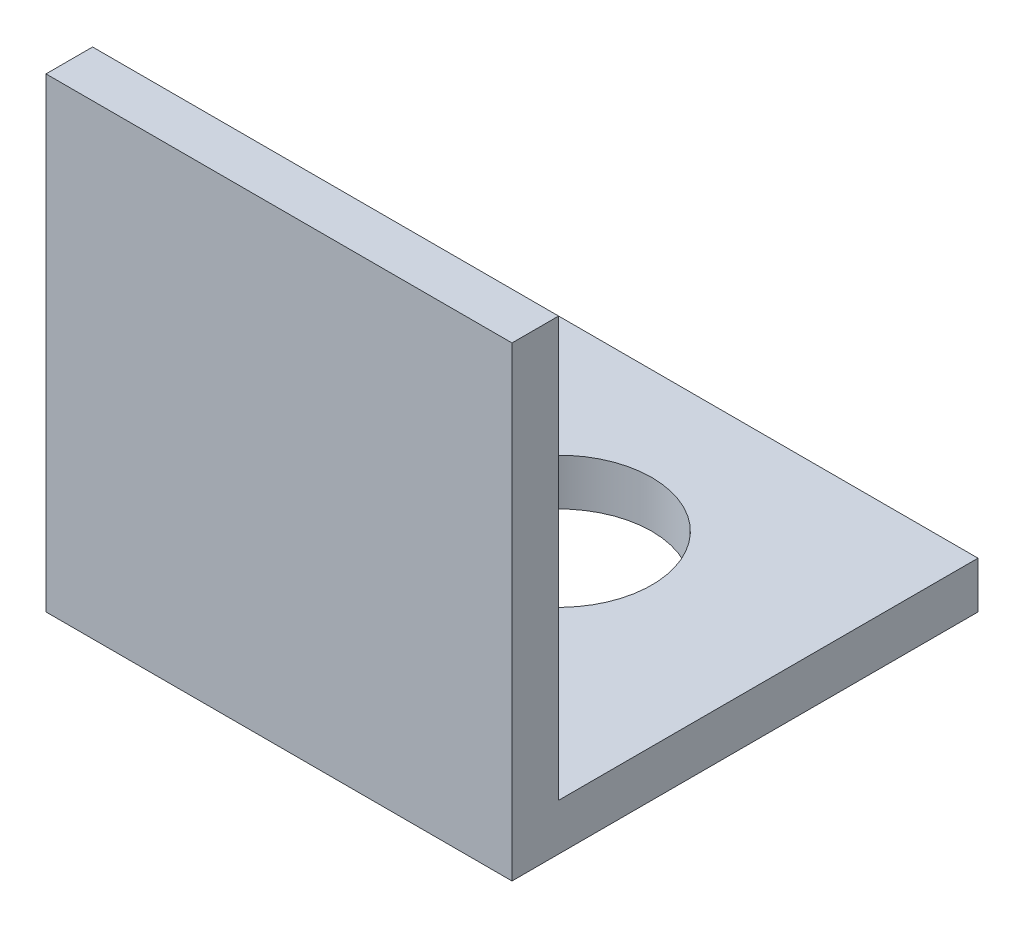
ISO-10303-21;
HEADER;
FILE_DESCRIPTION(('STEP AP214'),'2;1');
FILE_NAME('part.step','',(''),(''),'','','');
FILE_SCHEMA(('AUTOMOTIVE_DESIGN { 1 0 10303 214 1 1 1 1 }'));
ENDSEC;
DATA;
#1=APPLICATION_CONTEXT('core data for automotive mechanical design processes');
#2=APPLICATION_PROTOCOL_DEFINITION('international standard','automotive_design',2000,#1);
#3=PRODUCT_CONTEXT('',#1,'mechanical');
#4=PRODUCT('Part','Part','',(#3));
#5=PRODUCT_RELATED_PRODUCT_CATEGORY('part','',(#4));
#6=PRODUCT_DEFINITION_FORMATION('','',#4);
#7=PRODUCT_DEFINITION_CONTEXT('part definition',#1,'design');
#8=PRODUCT_DEFINITION('design','',#6,#7);
#9=PRODUCT_DEFINITION_SHAPE('','',#8);
#10=(LENGTH_UNIT() NAMED_UNIT(*) SI_UNIT(.MILLI.,.METRE.));
#11=(NAMED_UNIT(*) PLANE_ANGLE_UNIT() SI_UNIT($,.RADIAN.));
#12=(NAMED_UNIT(*) SI_UNIT($,.STERADIAN.) SOLID_ANGLE_UNIT());
#13=UNCERTAINTY_MEASURE_WITH_UNIT(LENGTH_MEASURE(1.E-05),#10,'distance_accuracy_value','');
#14=(GEOMETRIC_REPRESENTATION_CONTEXT(3) GLOBAL_UNCERTAINTY_ASSIGNED_CONTEXT((#13)) GLOBAL_UNIT_ASSIGNED_CONTEXT((#10,
#11,#12)) REPRESENTATION_CONTEXT('',''));
#15=CARTESIAN_POINT('',(0.,0.,0.));
#16=DIRECTION('',(0.,0.,1.));
#17=DIRECTION('',(1.,0.,0.));
#18=AXIS2_PLACEMENT_3D('',#15,#16,#17);
#19=CARTESIAN_POINT('',(30.,0.,0.));
#20=DIRECTION('',(0.,1.,0.));
#21=DIRECTION('',(0.,0.,1.));
#22=AXIS2_PLACEMENT_3D('',#19,#20,#21);
#23=PLANE('',#22);
#24=CARTESIAN_POINT('',(15.,0.,-18.));
#25=DIRECTION('',(0.,-1.,0.));
#26=DIRECTION('',(0.,0.,-1.));
#27=AXIS2_PLACEMENT_3D('',#24,#25,#26);
#28=CIRCLE('',#27,6.);
#29=CARTESIAN_POINT('',(15.,0.,-24.));
#30=VERTEX_POINT('',#29);
#31=EDGE_CURVE('E161',#30,#30,#28,.T.);
#32=ORIENTED_EDGE('',*,*,#31,.F.);
#33=EDGE_LOOP('',(#32));
#34=FACE_BOUND('',#33,.T.);
#35=DIRECTION('',(0.,0.,-1.));
#36=VECTOR('',#35,1.);
#37=CARTESIAN_POINT('',(0.,0.,0.));
#38=LINE('',#37,#36);
#39=CARTESIAN_POINT('',(0.,0.,0.));
#40=VERTEX_POINT('',#39);
#41=CARTESIAN_POINT('',(0.,0.,-30.));
#42=VERTEX_POINT('',#41);
#43=EDGE_CURVE('E117',#40,#42,#38,.T.);
#44=ORIENTED_EDGE('',*,*,#43,.T.);
#45=DIRECTION('',(-1.,0.,0.));
#46=VECTOR('',#45,1.);
#47=CARTESIAN_POINT('',(30.,0.,-30.));
#48=LINE('',#47,#46);
#49=CARTESIAN_POINT('',(30.,0.,-30.));
#50=VERTEX_POINT('',#49);
#51=EDGE_CURVE('E11',#50,#42,#48,.T.);
#52=ORIENTED_EDGE('',*,*,#51,.F.);
#53=DIRECTION('',(0.,0.,-1.));
#54=VECTOR('',#53,1.);
#55=CARTESIAN_POINT('',(30.,0.,0.));
#56=LINE('',#55,#54);
#57=CARTESIAN_POINT('',(30.,0.,0.));
#58=VERTEX_POINT('',#57);
#59=EDGE_CURVE('E82',#58,#50,#56,.T.);
#60=ORIENTED_EDGE('',*,*,#59,.F.);
#61=DIRECTION('',(-1.,0.,0.));
#62=VECTOR('',#61,1.);
#63=CARTESIAN_POINT('',(30.,0.,0.));
#64=LINE('',#63,#62);
#65=EDGE_CURVE('E113',#58,#40,#64,.T.);
#66=ORIENTED_EDGE('',*,*,#65,.T.);
#67=EDGE_LOOP('',(#44,#52,#60,#66));
#68=FACE_BOUND('',#67,.T.);
#69=ADVANCED_FACE('F35',(#34,#68),#23,.F.);
#70=CARTESIAN_POINT('',(30.,3.,-30.));
#71=DIRECTION('',(0.,0.,-1.));
#72=DIRECTION('',(-1.,0.,0.));
#73=AXIS2_PLACEMENT_3D('',#70,#71,#72);
#74=PLANE('',#73);
#75=DIRECTION('',(0.,-1.,0.));
#76=VECTOR('',#75,1.);
#77=CARTESIAN_POINT('',(0.,3.,-30.));
#78=LINE('',#77,#76);
#79=CARTESIAN_POINT('',(0.,3.,-30.));
#80=VERTEX_POINT('',#79);
#81=EDGE_CURVE('E120',#80,#42,#78,.T.);
#82=ORIENTED_EDGE('',*,*,#81,.F.);
#83=DIRECTION('',(-1.,0.,0.));
#84=VECTOR('',#83,1.);
#85=CARTESIAN_POINT('',(30.,3.,-30.));
#86=LINE('',#85,#84);
#87=CARTESIAN_POINT('',(30.,3.,-30.));
#88=VERTEX_POINT('',#87);
#89=EDGE_CURVE('E44',#88,#80,#86,.T.);
#90=ORIENTED_EDGE('',*,*,#89,.F.);
#91=DIRECTION('',(0.,-1.,0.));
#92=VECTOR('',#91,1.);
#93=CARTESIAN_POINT('',(30.,3.,-30.));
#94=LINE('',#93,#92);
#95=EDGE_CURVE('E167',#88,#50,#94,.T.);
#96=ORIENTED_EDGE('',*,*,#95,.T.);
#97=ORIENTED_EDGE('',*,*,#51,.T.);
#98=EDGE_LOOP('',(#82,#90,#96,#97));
#99=FACE_BOUND('',#98,.T.);
#100=ADVANCED_FACE('F139',(#99),#74,.T.);
#101=CARTESIAN_POINT('',(30.,3.,0.));
#102=DIRECTION('',(0.,1.,0.));
#103=DIRECTION('',(0.,0.,1.));
#104=AXIS2_PLACEMENT_3D('',#101,#102,#103);
#105=PLANE('',#104);
#106=CARTESIAN_POINT('',(15.,3.,-18.));
#107=DIRECTION('',(0.,1.,0.));
#108=DIRECTION('',(0.,0.,1.));
#109=AXIS2_PLACEMENT_3D('',#106,#107,#108);
#110=CIRCLE('',#109,6.);
#111=CARTESIAN_POINT('',(15.,3.,-12.));
#112=VERTEX_POINT('',#111);
#113=EDGE_CURVE('E38',#112,#112,#110,.T.);
#114=ORIENTED_EDGE('',*,*,#113,.F.);
#115=EDGE_LOOP('',(#114));
#116=FACE_BOUND('',#115,.T.);
#117=DIRECTION('',(0.,0.,-1.));
#118=VECTOR('',#117,1.);
#119=CARTESIAN_POINT('',(0.,3.,0.));
#120=LINE('',#119,#118);
#121=CARTESIAN_POINT('',(0.,3.,-3.));
#122=VERTEX_POINT('',#121);
#123=EDGE_CURVE('E123',#122,#80,#120,.T.);
#124=ORIENTED_EDGE('',*,*,#123,.F.);
#125=DIRECTION('',(-1.,0.,0.));
#126=VECTOR('',#125,1.);
#127=CARTESIAN_POINT('',(30.,3.,-3.));
#128=LINE('',#127,#126);
#129=CARTESIAN_POINT('',(30.,3.,-3.));
#130=VERTEX_POINT('',#129);
#131=EDGE_CURVE('E103',#130,#122,#128,.T.);
#132=ORIENTED_EDGE('',*,*,#131,.F.);
#133=DIRECTION('',(0.,0.,-1.));
#134=VECTOR('',#133,1.);
#135=CARTESIAN_POINT('',(30.,3.,0.));
#136=LINE('',#135,#134);
#137=EDGE_CURVE('E109',#130,#88,#136,.T.);
#138=ORIENTED_EDGE('',*,*,#137,.T.);
#139=ORIENTED_EDGE('',*,*,#89,.T.);
#140=EDGE_LOOP('',(#124,#132,#138,#139));
#141=FACE_BOUND('',#140,.T.);
#142=ADVANCED_FACE('F136',(#116,#141),#105,.T.);
#143=CARTESIAN_POINT('',(30.,30.,-3.));
#144=DIRECTION('',(0.,0.,-1.));
#145=DIRECTION('',(0.,1.,0.));
#146=AXIS2_PLACEMENT_3D('',#143,#144,#145);
#147=PLANE('',#146);
#148=DIRECTION('',(0.,-1.,0.));
#149=VECTOR('',#148,1.);
#150=CARTESIAN_POINT('',(0.,30.,-3.));
#151=LINE('',#150,#149);
#152=CARTESIAN_POINT('',(0.,30.,-3.));
#153=VERTEX_POINT('',#152);
#154=EDGE_CURVE('E98',#153,#122,#151,.T.);
#155=ORIENTED_EDGE('',*,*,#154,.F.);
#156=DIRECTION('',(-1.,0.,0.));
#157=VECTOR('',#156,1.);
#158=CARTESIAN_POINT('',(30.,30.,-3.));
#159=LINE('',#158,#157);
#160=CARTESIAN_POINT('',(30.,30.,-3.));
#161=VERTEX_POINT('',#160);
#162=EDGE_CURVE('E93',#161,#153,#159,.T.);
#163=ORIENTED_EDGE('',*,*,#162,.F.);
#164=DIRECTION('',(0.,-1.,0.));
#165=VECTOR('',#164,1.);
#166=CARTESIAN_POINT('',(30.,30.,-3.));
#167=LINE('',#166,#165);
#168=EDGE_CURVE('E96',#161,#130,#167,.T.);
#169=ORIENTED_EDGE('',*,*,#168,.T.);
#170=ORIENTED_EDGE('',*,*,#131,.T.);
#171=EDGE_LOOP('',(#155,#163,#169,#170));
#172=FACE_BOUND('',#171,.T.);
#173=ADVANCED_FACE('F95',(#172),#147,.T.);
#174=CARTESIAN_POINT('',(30.,30.,0.));
#175=DIRECTION('',(0.,1.,0.));
#176=DIRECTION('',(0.,0.,1.));
#177=AXIS2_PLACEMENT_3D('',#174,#175,#176);
#178=PLANE('',#177);
#179=DIRECTION('',(0.,0.,-1.));
#180=VECTOR('',#179,1.);
#181=CARTESIAN_POINT('',(0.,30.,0.));
#182=LINE('',#181,#180);
#183=CARTESIAN_POINT('',(0.,30.,0.));
#184=VERTEX_POINT('',#183);
#185=EDGE_CURVE('E127',#184,#153,#182,.T.);
#186=ORIENTED_EDGE('',*,*,#185,.F.);
#187=DIRECTION('',(-1.,0.,0.));
#188=VECTOR('',#187,1.);
#189=CARTESIAN_POINT('',(30.,30.,0.));
#190=LINE('',#189,#188);
#191=CARTESIAN_POINT('',(30.,30.,0.));
#192=VERTEX_POINT('',#191);
#193=EDGE_CURVE('E73',#192,#184,#190,.T.);
#194=ORIENTED_EDGE('',*,*,#193,.F.);
#195=DIRECTION('',(0.,0.,-1.));
#196=VECTOR('',#195,1.);
#197=CARTESIAN_POINT('',(30.,30.,0.));
#198=LINE('',#197,#196);
#199=EDGE_CURVE('E107',#192,#161,#198,.T.);
#200=ORIENTED_EDGE('',*,*,#199,.T.);
#201=ORIENTED_EDGE('',*,*,#162,.T.);
#202=EDGE_LOOP('',(#186,#194,#200,#201));
#203=FACE_BOUND('',#202,.T.);
#204=ADVANCED_FACE('F111',(#203),#178,.T.);
#205=CARTESIAN_POINT('',(30.,30.,0.));
#206=DIRECTION('',(0.,0.,-1.));
#207=DIRECTION('',(0.,1.,0.));
#208=AXIS2_PLACEMENT_3D('',#205,#206,#207);
#209=PLANE('',#208);
#210=DIRECTION('',(0.,-1.,0.));
#211=VECTOR('',#210,1.);
#212=CARTESIAN_POINT('',(0.,30.,0.));
#213=LINE('',#212,#211);
#214=EDGE_CURVE('E76',#184,#40,#213,.T.);
#215=ORIENTED_EDGE('',*,*,#214,.T.);
#216=ORIENTED_EDGE('',*,*,#65,.F.);
#217=DIRECTION('',(0.,-1.,0.));
#218=VECTOR('',#217,1.);
#219=CARTESIAN_POINT('',(30.,30.,0.));
#220=LINE('',#219,#218);
#221=EDGE_CURVE('E52',#192,#58,#220,.T.);
#222=ORIENTED_EDGE('',*,*,#221,.F.);
#223=ORIENTED_EDGE('',*,*,#193,.T.);
#224=EDGE_LOOP('',(#215,#216,#222,#223));
#225=FACE_BOUND('',#224,.T.);
#226=ADVANCED_FACE('F144',(#225),#209,.F.);
#227=CARTESIAN_POINT('',(30.,0.,0.));
#228=DIRECTION('',(-1.,0.,0.));
#229=DIRECTION('',(0.,0.,1.));
#230=AXIS2_PLACEMENT_3D('',#227,#228,#229);
#231=PLANE('',#230);
#232=ORIENTED_EDGE('',*,*,#59,.T.);
#233=ORIENTED_EDGE('',*,*,#95,.F.);
#234=ORIENTED_EDGE('',*,*,#137,.F.);
#235=ORIENTED_EDGE('',*,*,#168,.F.);
#236=ORIENTED_EDGE('',*,*,#199,.F.);
#237=ORIENTED_EDGE('',*,*,#221,.T.);
#238=EDGE_LOOP('',(#232,#233,#234,#235,#236,#237));
#239=FACE_BOUND('',#238,.T.);
#240=ADVANCED_FACE('F106',(#239),#231,.F.);
#241=CARTESIAN_POINT('',(0.,0.,0.));
#242=DIRECTION('',(-1.,0.,0.));
#243=DIRECTION('',(0.,0.,1.));
#244=AXIS2_PLACEMENT_3D('',#241,#242,#243);
#245=PLANE('',#244);
#246=ORIENTED_EDGE('',*,*,#43,.F.);
#247=ORIENTED_EDGE('',*,*,#214,.F.);
#248=ORIENTED_EDGE('',*,*,#185,.T.);
#249=ORIENTED_EDGE('',*,*,#154,.T.);
#250=ORIENTED_EDGE('',*,*,#123,.T.);
#251=ORIENTED_EDGE('',*,*,#81,.T.);
#252=EDGE_LOOP('',(#246,#247,#248,#249,#250,#251));
#253=FACE_BOUND('',#252,.T.);
#254=ADVANCED_FACE('F142',(#253),#245,.T.);
#255=CARTESIAN_POINT('',(15.,30.,-18.));
#256=DIRECTION('',(0.,-1.,0.));
#257=DIRECTION('',(0.,0.,-1.));
#258=AXIS2_PLACEMENT_3D('',#255,#256,#257);
#259=CYLINDRICAL_SURFACE('',#258,6.);
#260=ORIENTED_EDGE('',*,*,#113,.T.);
#261=EDGE_LOOP('',(#260));
#262=FACE_BOUND('',#261,.T.);
#263=ORIENTED_EDGE('',*,*,#31,.T.);
#264=EDGE_LOOP('',(#263));
#265=FACE_BOUND('',#264,.T.);
#266=ADVANCED_FACE('F170',(#262,#265),#259,.F.);
#267=CLOSED_SHELL('',(#69,#100,#142,#173,#204,#226,#240,#254,#266));
#268=MANIFOLD_SOLID_BREP('B2',#267);
#269=ADVANCED_BREP_SHAPE_REPRESENTATION('',(#18,#268),#14);
#270=SHAPE_DEFINITION_REPRESENTATION(#9,#269);
ENDSEC;
END-ISO-10303-21;
